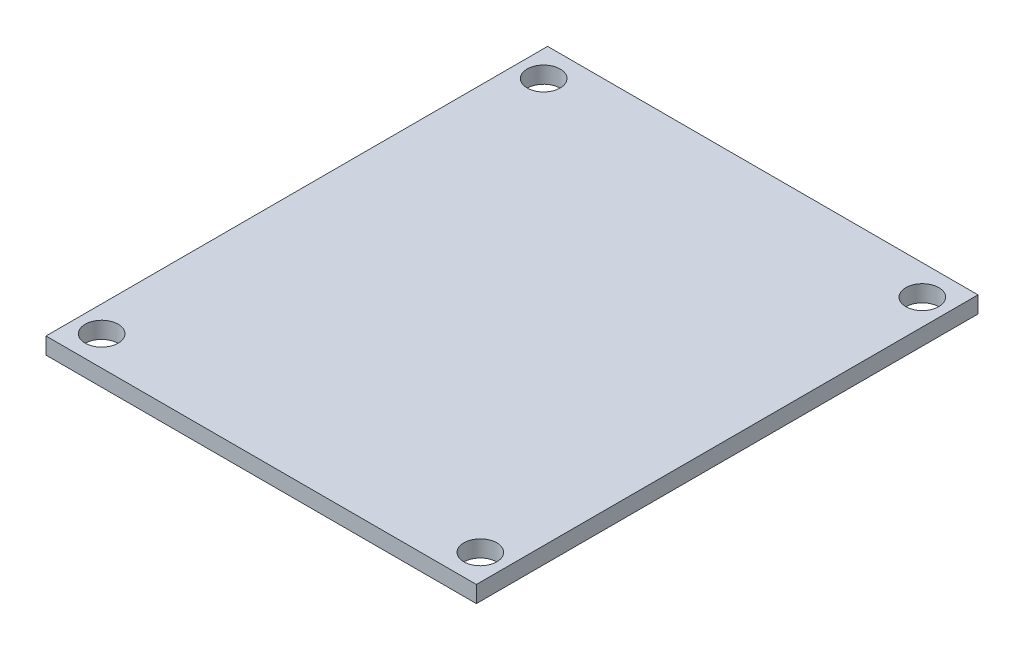
ISO-10303-21;
HEADER;
FILE_DESCRIPTION(('STEP AP214'),'2;1');
FILE_NAME('part.step','',(''),(''),'','','');
FILE_SCHEMA(('AUTOMOTIVE_DESIGN { 1 0 10303 214 1 1 1 1 }'));
ENDSEC;
DATA;
#1=APPLICATION_CONTEXT('core data for automotive mechanical design processes');
#2=APPLICATION_PROTOCOL_DEFINITION('international standard','automotive_design',2000,#1);
#3=PRODUCT_CONTEXT('',#1,'mechanical');
#4=PRODUCT('Part','Part','',(#3));
#5=PRODUCT_RELATED_PRODUCT_CATEGORY('part','',(#4));
#6=PRODUCT_DEFINITION_FORMATION('','',#4);
#7=PRODUCT_DEFINITION_CONTEXT('part definition',#1,'design');
#8=PRODUCT_DEFINITION('design','',#6,#7);
#9=PRODUCT_DEFINITION_SHAPE('','',#8);
#10=(LENGTH_UNIT() NAMED_UNIT(*) SI_UNIT(.MILLI.,.METRE.));
#11=(NAMED_UNIT(*) PLANE_ANGLE_UNIT() SI_UNIT($,.RADIAN.));
#12=(NAMED_UNIT(*) SI_UNIT($,.STERADIAN.) SOLID_ANGLE_UNIT());
#13=UNCERTAINTY_MEASURE_WITH_UNIT(LENGTH_MEASURE(1.E-05),#10,'distance_accuracy_value','');
#14=(GEOMETRIC_REPRESENTATION_CONTEXT(3) GLOBAL_UNCERTAINTY_ASSIGNED_CONTEXT((#13)) GLOBAL_UNIT_ASSIGNED_CONTEXT((#10,
#11,#12)) REPRESENTATION_CONTEXT('',''));
#15=CARTESIAN_POINT('',(0.,0.,0.));
#16=DIRECTION('',(0.,0.,1.));
#17=DIRECTION('',(1.,0.,0.));
#18=AXIS2_PLACEMENT_3D('',#15,#16,#17);
#19=CARTESIAN_POINT('',(20.7137,0.,-24.1427));
#20=DIRECTION('',(-1.,0.,0.));
#21=DIRECTION('',(0.,0.,1.));
#22=AXIS2_PLACEMENT_3D('',#19,#20,#21);
#23=PLANE('',#22);
#24=DIRECTION('',(0.,1.,0.));
#25=VECTOR('',#24,1.);
#26=CARTESIAN_POINT('',(20.7137,0.8,-24.1427));
#27=LINE('',#26,#25);
#28=CARTESIAN_POINT('',(20.7137,0.,-24.1427));
#29=VERTEX_POINT('',#28);
#30=CARTESIAN_POINT('',(20.7137,1.6,-24.1427));
#31=VERTEX_POINT('',#30);
#32=EDGE_CURVE('E67',#29,#31,#27,.T.);
#33=ORIENTED_EDGE('',*,*,#32,.T.);
#34=DIRECTION('',(0.,0.,1.));
#35=VECTOR('',#34,1.);
#36=CARTESIAN_POINT('',(20.7137,1.6,0.));
#37=LINE('',#36,#35);
#38=CARTESIAN_POINT('',(20.7137,1.6,24.1427));
#39=VERTEX_POINT('',#38);
#40=EDGE_CURVE('E106',#31,#39,#37,.T.);
#41=ORIENTED_EDGE('',*,*,#40,.T.);
#42=DIRECTION('',(0.,-1.,0.));
#43=VECTOR('',#42,1.);
#44=CARTESIAN_POINT('',(20.7137,0.8,24.1427));
#45=LINE('',#44,#43);
#46=CARTESIAN_POINT('',(20.7137,0.,24.1427));
#47=VERTEX_POINT('',#46);
#48=EDGE_CURVE('E57',#39,#47,#45,.T.);
#49=ORIENTED_EDGE('',*,*,#48,.T.);
#50=DIRECTION('',(0.,0.,1.));
#51=VECTOR('',#50,1.);
#52=CARTESIAN_POINT('',(20.7137,0.,0.));
#53=LINE('',#52,#51);
#54=EDGE_CURVE('E100',#29,#47,#53,.T.);
#55=ORIENTED_EDGE('',*,*,#54,.F.);
#56=EDGE_LOOP('',(#33,#41,#49,#55));
#57=FACE_BOUND('',#56,.T.);
#58=ADVANCED_FACE('F17',(#57),#23,.F.);
#59=CARTESIAN_POINT('',(20.7137,0.,24.1427));
#60=DIRECTION('',(0.,0.,-1.));
#61=DIRECTION('',(-1.,0.,0.));
#62=AXIS2_PLACEMENT_3D('',#59,#60,#61);
#63=PLANE('',#62);
#64=ORIENTED_EDGE('',*,*,#48,.F.);
#65=DIRECTION('',(-1.,0.,0.));
#66=VECTOR('',#65,1.);
#67=CARTESIAN_POINT('',(0.,1.6,24.1427));
#68=LINE('',#67,#66);
#69=CARTESIAN_POINT('',(-20.7137,1.6,24.1427));
#70=VERTEX_POINT('',#69);
#71=EDGE_CURVE('E73',#39,#70,#68,.T.);
#72=ORIENTED_EDGE('',*,*,#71,.T.);
#73=DIRECTION('',(0.,-1.,0.));
#74=VECTOR('',#73,1.);
#75=CARTESIAN_POINT('',(-20.7137,0.8,24.1427));
#76=LINE('',#75,#74);
#77=CARTESIAN_POINT('',(-20.7137,0.,24.1427));
#78=VERTEX_POINT('',#77);
#79=EDGE_CURVE('E63',#70,#78,#76,.T.);
#80=ORIENTED_EDGE('',*,*,#79,.T.);
#81=DIRECTION('',(-1.,0.,0.));
#82=VECTOR('',#81,1.);
#83=CARTESIAN_POINT('',(0.,0.,24.1427));
#84=LINE('',#83,#82);
#85=EDGE_CURVE('E113',#47,#78,#84,.T.);
#86=ORIENTED_EDGE('',*,*,#85,.F.);
#87=EDGE_LOOP('',(#64,#72,#80,#86));
#88=FACE_BOUND('',#87,.T.);
#89=ADVANCED_FACE('F78',(#88),#63,.F.);
#90=CARTESIAN_POINT('',(-20.7137,0.,24.1427));
#91=DIRECTION('',(1.,0.,0.));
#92=DIRECTION('',(0.,0.,-1.));
#93=AXIS2_PLACEMENT_3D('',#90,#91,#92);
#94=PLANE('',#93);
#95=ORIENTED_EDGE('',*,*,#79,.F.);
#96=DIRECTION('',(0.,0.,-1.));
#97=VECTOR('',#96,1.);
#98=CARTESIAN_POINT('',(-20.7137,1.6,0.));
#99=LINE('',#98,#97);
#100=CARTESIAN_POINT('',(-20.7137,1.6,-24.1427));
#101=VERTEX_POINT('',#100);
#102=EDGE_CURVE('E66',#70,#101,#99,.T.);
#103=ORIENTED_EDGE('',*,*,#102,.T.);
#104=DIRECTION('',(0.,-1.,0.));
#105=VECTOR('',#104,1.);
#106=CARTESIAN_POINT('',(-20.7137,0.8,-24.1427));
#107=LINE('',#106,#105);
#108=CARTESIAN_POINT('',(-20.7137,0.,-24.1427));
#109=VERTEX_POINT('',#108);
#110=EDGE_CURVE('E79',#101,#109,#107,.T.);
#111=ORIENTED_EDGE('',*,*,#110,.T.);
#112=DIRECTION('',(0.,0.,-1.));
#113=VECTOR('',#112,1.);
#114=CARTESIAN_POINT('',(-20.7137,0.,0.));
#115=LINE('',#114,#113);
#116=EDGE_CURVE('E36',#78,#109,#115,.T.);
#117=ORIENTED_EDGE('',*,*,#116,.F.);
#118=EDGE_LOOP('',(#95,#103,#111,#117));
#119=FACE_BOUND('',#118,.T.);
#120=ADVANCED_FACE('F65',(#119),#94,.F.);
#121=CARTESIAN_POINT('',(-20.7137,0.,-24.1427));
#122=DIRECTION('',(0.,0.,1.));
#123=DIRECTION('',(1.,0.,0.));
#124=AXIS2_PLACEMENT_3D('',#121,#122,#123);
#125=PLANE('',#124);
#126=ORIENTED_EDGE('',*,*,#110,.F.);
#127=DIRECTION('',(1.,0.,0.));
#128=VECTOR('',#127,1.);
#129=CARTESIAN_POINT('',(0.,1.6,-24.1427));
#130=LINE('',#129,#128);
#131=EDGE_CURVE('E76',#101,#31,#130,.T.);
#132=ORIENTED_EDGE('',*,*,#131,.T.);
#133=ORIENTED_EDGE('',*,*,#32,.F.);
#134=DIRECTION('',(1.,0.,0.));
#135=VECTOR('',#134,1.);
#136=CARTESIAN_POINT('',(0.,0.,-24.1427));
#137=LINE('',#136,#135);
#138=EDGE_CURVE('E97',#109,#29,#137,.T.);
#139=ORIENTED_EDGE('',*,*,#138,.F.);
#140=EDGE_LOOP('',(#126,#132,#133,#139));
#141=FACE_BOUND('',#140,.T.);
#142=ADVANCED_FACE('F119',(#141),#125,.F.);
#143=CARTESIAN_POINT('',(18.2245,1.6,-21.2725));
#144=DIRECTION('',(0.,-1.,0.));
#145=DIRECTION('',(0.,0.,-1.));
#146=AXIS2_PLACEMENT_3D('',#143,#144,#145);
#147=CYLINDRICAL_SURFACE('',#146,1.5875);
#148=CARTESIAN_POINT('',(18.2245,1.6,-21.2725));
#149=DIRECTION('',(0.,-1.,0.));
#150=DIRECTION('',(0.,0.,-1.));
#151=AXIS2_PLACEMENT_3D('',#148,#149,#150);
#152=CIRCLE('',#151,1.5875);
#153=CARTESIAN_POINT('',(18.2245,1.6,-22.86));
#154=VERTEX_POINT('',#153);
#155=EDGE_CURVE('E21',#154,#154,#152,.F.);
#156=ORIENTED_EDGE('',*,*,#155,.T.);
#157=EDGE_LOOP('',(#156));
#158=FACE_BOUND('',#157,.T.);
#159=CARTESIAN_POINT('',(18.2245,0.,-21.2725));
#160=DIRECTION('',(0.,-1.,0.));
#161=DIRECTION('',(0.,0.,-1.));
#162=AXIS2_PLACEMENT_3D('',#159,#160,#161);
#163=CIRCLE('',#162,1.5875);
#164=CARTESIAN_POINT('',(18.2245,0.,-22.86));
#165=VERTEX_POINT('',#164);
#166=EDGE_CURVE('E94',#165,#165,#163,.F.);
#167=ORIENTED_EDGE('',*,*,#166,.F.);
#168=EDGE_LOOP('',(#167));
#169=FACE_BOUND('',#168,.T.);
#170=ADVANCED_FACE('F121',(#158,#169),#147,.F.);
#171=CARTESIAN_POINT('',(-18.2245,1.6,21.2725));
#172=DIRECTION('',(0.,-1.,0.));
#173=DIRECTION('',(0.,0.,-1.));
#174=AXIS2_PLACEMENT_3D('',#171,#172,#173);
#175=CYLINDRICAL_SURFACE('',#174,1.5875);
#176=CARTESIAN_POINT('',(-18.2245,1.6,21.2725));
#177=DIRECTION('',(0.,-1.,0.));
#178=DIRECTION('',(0.,0.,-1.));
#179=AXIS2_PLACEMENT_3D('',#176,#177,#178);
#180=CIRCLE('',#179,1.5875);
#181=CARTESIAN_POINT('',(-18.2245,1.6,19.685));
#182=VERTEX_POINT('',#181);
#183=EDGE_CURVE('E101',#182,#182,#180,.F.);
#184=ORIENTED_EDGE('',*,*,#183,.T.);
#185=EDGE_LOOP('',(#184));
#186=FACE_BOUND('',#185,.T.);
#187=CARTESIAN_POINT('',(-18.2245,0.,21.2725));
#188=DIRECTION('',(0.,-1.,0.));
#189=DIRECTION('',(0.,0.,-1.));
#190=AXIS2_PLACEMENT_3D('',#187,#188,#189);
#191=CIRCLE('',#190,1.5875);
#192=CARTESIAN_POINT('',(-18.2245,0.,19.685));
#193=VERTEX_POINT('',#192);
#194=EDGE_CURVE('E91',#193,#193,#191,.F.);
#195=ORIENTED_EDGE('',*,*,#194,.F.);
#196=EDGE_LOOP('',(#195));
#197=FACE_BOUND('',#196,.T.);
#198=ADVANCED_FACE('F128',(#186,#197),#175,.F.);
#199=CARTESIAN_POINT('',(18.2245,1.6,21.2725));
#200=DIRECTION('',(0.,-1.,0.));
#201=DIRECTION('',(0.,0.,-1.));
#202=AXIS2_PLACEMENT_3D('',#199,#200,#201);
#203=CYLINDRICAL_SURFACE('',#202,1.5875);
#204=CARTESIAN_POINT('',(18.2245,1.6,21.2725));
#205=DIRECTION('',(0.,-1.,0.));
#206=DIRECTION('',(0.,0.,-1.));
#207=AXIS2_PLACEMENT_3D('',#204,#205,#206);
#208=CIRCLE('',#207,1.5875);
#209=CARTESIAN_POINT('',(18.2245,1.6,19.685));
#210=VERTEX_POINT('',#209);
#211=EDGE_CURVE('E98',#210,#210,#208,.F.);
#212=ORIENTED_EDGE('',*,*,#211,.T.);
#213=EDGE_LOOP('',(#212));
#214=FACE_BOUND('',#213,.T.);
#215=CARTESIAN_POINT('',(18.2245,0.,21.2725));
#216=DIRECTION('',(0.,-1.,0.));
#217=DIRECTION('',(0.,0.,-1.));
#218=AXIS2_PLACEMENT_3D('',#215,#216,#217);
#219=CIRCLE('',#218,1.5875);
#220=CARTESIAN_POINT('',(18.2245,0.,19.685));
#221=VERTEX_POINT('',#220);
#222=EDGE_CURVE('E88',#221,#221,#219,.F.);
#223=ORIENTED_EDGE('',*,*,#222,.F.);
#224=EDGE_LOOP('',(#223));
#225=FACE_BOUND('',#224,.T.);
#226=ADVANCED_FACE('F141',(#214,#225),#203,.F.);
#227=CARTESIAN_POINT('',(-20.7137,1.6,24.1427));
#228=DIRECTION('',(0.,-1.,0.));
#229=DIRECTION('',(0.,0.,-1.));
#230=AXIS2_PLACEMENT_3D('',#227,#228,#229);
#231=PLANE('',#230);
#232=CARTESIAN_POINT('',(-18.2245,1.6,-21.2725));
#233=DIRECTION('',(0.,-1.,0.));
#234=DIRECTION('',(0.,0.,-1.));
#235=AXIS2_PLACEMENT_3D('',#232,#233,#234);
#236=CIRCLE('',#235,1.5875);
#237=CARTESIAN_POINT('',(-18.2245,1.6,-22.86));
#238=VERTEX_POINT('',#237);
#239=EDGE_CURVE('E27',#238,#238,#236,.F.);
#240=ORIENTED_EDGE('',*,*,#239,.F.);
#241=EDGE_LOOP('',(#240));
#242=FACE_BOUND('',#241,.T.);
#243=ORIENTED_EDGE('',*,*,#211,.F.);
#244=EDGE_LOOP('',(#243));
#245=FACE_BOUND('',#244,.T.);
#246=ORIENTED_EDGE('',*,*,#183,.F.);
#247=EDGE_LOOP('',(#246));
#248=FACE_BOUND('',#247,.T.);
#249=ORIENTED_EDGE('',*,*,#155,.F.);
#250=EDGE_LOOP('',(#249));
#251=FACE_BOUND('',#250,.T.);
#252=ORIENTED_EDGE('',*,*,#131,.F.);
#253=ORIENTED_EDGE('',*,*,#102,.F.);
#254=ORIENTED_EDGE('',*,*,#71,.F.);
#255=ORIENTED_EDGE('',*,*,#40,.F.);
#256=EDGE_LOOP('',(#252,#253,#254,#255));
#257=FACE_BOUND('',#256,.T.);
#258=ADVANCED_FACE('F71',(#242,#245,#248,#251,#257),#231,.F.);
#259=CARTESIAN_POINT('',(-20.7137,0.,24.1427));
#260=DIRECTION('',(0.,-1.,0.));
#261=DIRECTION('',(0.,0.,-1.));
#262=AXIS2_PLACEMENT_3D('',#259,#260,#261);
#263=PLANE('',#262);
#264=CARTESIAN_POINT('',(-18.2245,0.,-21.2725));
#265=DIRECTION('',(0.,-1.,0.));
#266=DIRECTION('',(0.,0.,-1.));
#267=AXIS2_PLACEMENT_3D('',#264,#265,#266);
#268=CIRCLE('',#267,1.5875);
#269=CARTESIAN_POINT('',(-18.2245,0.,-22.86));
#270=VERTEX_POINT('',#269);
#271=EDGE_CURVE('E11',#270,#270,#268,.T.);
#272=ORIENTED_EDGE('',*,*,#271,.F.);
#273=EDGE_LOOP('',(#272));
#274=FACE_BOUND('',#273,.T.);
#275=ORIENTED_EDGE('',*,*,#222,.T.);
#276=EDGE_LOOP('',(#275));
#277=FACE_BOUND('',#276,.T.);
#278=ORIENTED_EDGE('',*,*,#194,.T.);
#279=EDGE_LOOP('',(#278));
#280=FACE_BOUND('',#279,.T.);
#281=ORIENTED_EDGE('',*,*,#166,.T.);
#282=EDGE_LOOP('',(#281));
#283=FACE_BOUND('',#282,.T.);
#284=ORIENTED_EDGE('',*,*,#116,.T.);
#285=ORIENTED_EDGE('',*,*,#138,.T.);
#286=ORIENTED_EDGE('',*,*,#54,.T.);
#287=ORIENTED_EDGE('',*,*,#85,.T.);
#288=EDGE_LOOP('',(#284,#285,#286,#287));
#289=FACE_BOUND('',#288,.T.);
#290=ADVANCED_FACE('F19',(#274,#277,#280,#283,#289),#263,.T.);
#291=CARTESIAN_POINT('',(-18.2245,1.6,-21.2725));
#292=DIRECTION('',(0.,-1.,0.));
#293=DIRECTION('',(0.,0.,-1.));
#294=AXIS2_PLACEMENT_3D('',#291,#292,#293);
#295=CYLINDRICAL_SURFACE('',#294,1.5875);
#296=ORIENTED_EDGE('',*,*,#239,.T.);
#297=EDGE_LOOP('',(#296));
#298=FACE_BOUND('',#297,.T.);
#299=ORIENTED_EDGE('',*,*,#271,.T.);
#300=EDGE_LOOP('',(#299));
#301=FACE_BOUND('',#300,.T.);
#302=ADVANCED_FACE('F131',(#298,#301),#295,.F.);
#303=CLOSED_SHELL('',(#58,#89,#120,#142,#170,#198,#226,#258,#290,#302));
#304=MANIFOLD_SOLID_BREP('B1',#303);
#305=ADVANCED_BREP_SHAPE_REPRESENTATION('',(#18,#304),#14);
#306=SHAPE_DEFINITION_REPRESENTATION(#9,#305);
ENDSEC;
END-ISO-10303-21;
